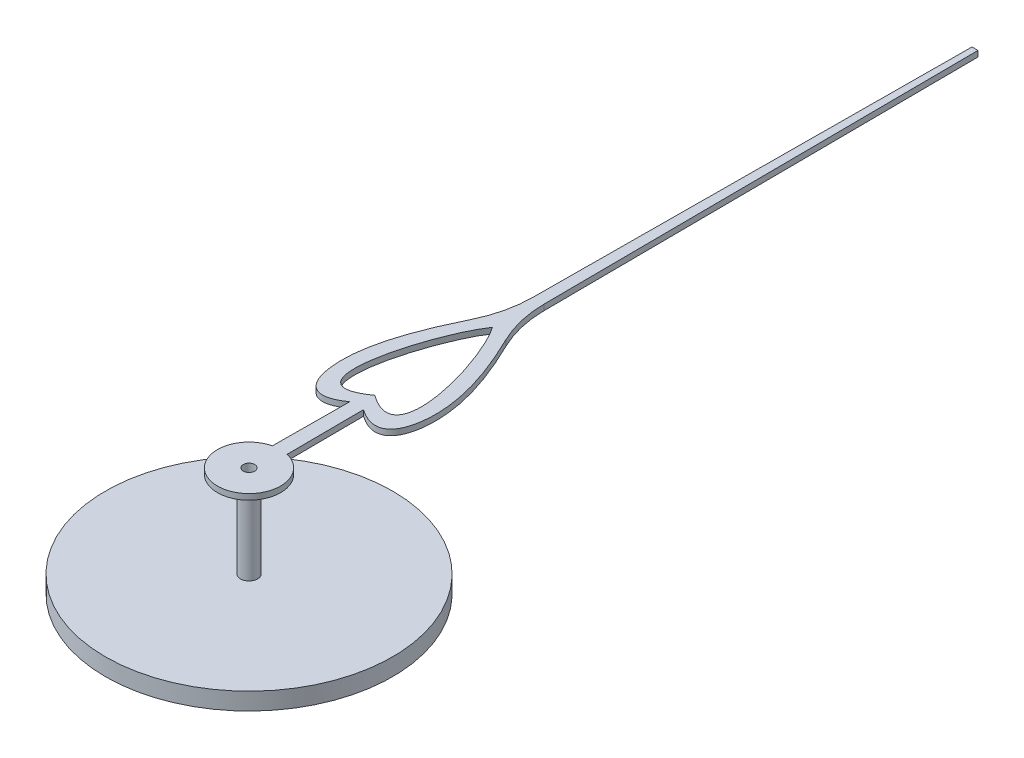
ISO-10303-21;
HEADER;
FILE_DESCRIPTION(('STEP AP214'),'2;1');
FILE_NAME('part.step','',(''),(''),'','','');
FILE_SCHEMA(('AUTOMOTIVE_DESIGN { 1 0 10303 214 1 1 1 1 }'));
ENDSEC;
DATA;
#1=APPLICATION_CONTEXT('core data for automotive mechanical design processes');
#2=APPLICATION_PROTOCOL_DEFINITION('international standard','automotive_design',2000,#1);
#3=PRODUCT_CONTEXT('',#1,'mechanical');
#4=PRODUCT('Part','Part','',(#3));
#5=PRODUCT_RELATED_PRODUCT_CATEGORY('part','',(#4));
#6=PRODUCT_DEFINITION_FORMATION('','',#4);
#7=PRODUCT_DEFINITION_CONTEXT('part definition',#1,'design');
#8=PRODUCT_DEFINITION('design','',#6,#7);
#9=PRODUCT_DEFINITION_SHAPE('','',#8);
#10=(LENGTH_UNIT() NAMED_UNIT(*) SI_UNIT(.MILLI.,.METRE.));
#11=(NAMED_UNIT(*) PLANE_ANGLE_UNIT() SI_UNIT($,.RADIAN.));
#12=(NAMED_UNIT(*) SI_UNIT($,.STERADIAN.) SOLID_ANGLE_UNIT());
#13=UNCERTAINTY_MEASURE_WITH_UNIT(LENGTH_MEASURE(1.E-05),#10,'distance_accuracy_value','');
#14=(GEOMETRIC_REPRESENTATION_CONTEXT(3) GLOBAL_UNCERTAINTY_ASSIGNED_CONTEXT((#13)) GLOBAL_UNIT_ASSIGNED_CONTEXT((#10,
#11,#12)) REPRESENTATION_CONTEXT('',''));
#15=CARTESIAN_POINT('',(0.,0.,0.));
#16=DIRECTION('',(0.,0.,1.));
#17=DIRECTION('',(1.,0.,0.));
#18=AXIS2_PLACEMENT_3D('',#15,#16,#17);
#19=CARTESIAN_POINT('',(-0.818484283328494,0.,-2.44789330945208));
#20=DIRECTION('',(0.,1.,0.));
#21=DIRECTION('',(0.,0.,1.));
#22=AXIS2_PLACEMENT_3D('',#19,#20,#21);
#23=PLANE('',#22);
#24=CARTESIAN_POINT('',(0.,0.,-2.18787424185007));
#25=CARTESIAN_POINT('',(1.05287403088658,0.,-1.43646078243729));
#26=CARTESIAN_POINT('',(0.435783261342512,0.,-3.61296055094113));
#27=CARTESIAN_POINT('',(0.,0.,-4.23880732225318));
#28=B_SPLINE_CURVE_WITH_KNOTS('',3,(#24,#25,#26,#27),.UNSPECIFIED.,.F.,.F.,(4,4),(0.,1.),.UNSPECIFIED.);
#29=CARTESIAN_POINT('',(0.,0.,-2.18787424185007));
#30=VERTEX_POINT('',#29);
#31=CARTESIAN_POINT('',(0.,0.,-4.23880732225318));
#32=VERTEX_POINT('',#31);
#33=EDGE_CURVE('E56',#30,#32,#28,.T.);
#34=ORIENTED_EDGE('',*,*,#33,.T.);
#35=CARTESIAN_POINT('',(0.,0.,-4.23880732225318));
#36=CARTESIAN_POINT('',(-0.435783261342511,0.,-3.61296055094112));
#37=CARTESIAN_POINT('',(-1.05287403088658,0.,-1.43646078243729));
#38=CARTESIAN_POINT('',(0.,0.,-2.18787424185007));
#39=B_SPLINE_CURVE_WITH_KNOTS('',3,(#35,#36,#37,#38),.UNSPECIFIED.,.F.,.F.,(4,4),(0.,1.),.UNSPECIFIED.);
#40=EDGE_CURVE('E133',#32,#30,#39,.T.);
#41=ORIENTED_EDGE('',*,*,#40,.T.);
#42=EDGE_LOOP('',(#34,#41));
#43=FACE_BOUND('',#42,.T.);
#44=CARTESIAN_POINT('',(-0.302826257694259,0.,-4.1712859886645));
#45=CARTESIAN_POINT('',(-0.624353855445742,0.,-3.51335934686763));
#46=CARTESIAN_POINT('',(-1.00426129114201,0.,-2.3859883039349));
#47=CARTESIAN_POINT('',(-0.641060695584215,0.,-1.50623728307088));
#48=CARTESIAN_POINT('',(-0.11954106823095,0.,-1.87342908304806));
#49=B_SPLINE_CURVE_WITH_KNOTS('',3,(#44,#45,#46,#47,#48),.UNSPECIFIED.,.F.,.F.,(4,1,4),(0.,
0.462172683660268,0.924345367320535),.UNSPECIFIED.);
#50=CARTESIAN_POINT('',(-0.302826257694231,0.,-4.17128598866449));
#51=VERTEX_POINT('',#50);
#52=CARTESIAN_POINT('',(-0.11954106823095,0.,-1.87342908304806));
#53=VERTEX_POINT('',#52);
#54=EDGE_CURVE('E209',#51,#53,#49,.T.);
#55=ORIENTED_EDGE('',*,*,#54,.F.);
#56=CARTESIAN_POINT('',(-2.09973012610236,0.,-5.04942976259905));
#57=DIRECTION('',(0.,-1.,0.));
#58=DIRECTION('',(0.,0.,1.));
#59=AXIS2_PLACEMENT_3D('',#56,#57,#58);
#60=CIRCLE('',#59,2.00000000000003);
#61=CARTESIAN_POINT('',(-0.0997691874579528,0.,-5.03693000673266));
#62=VERTEX_POINT('',#61);
#63=EDGE_CURVE('E238',#62,#51,#60,.T.);
#64=ORIENTED_EDGE('',*,*,#63,.F.);
#65=DIRECTION('',(-0.00624987793325496,0.,0.999980469322186));
#66=VECTOR('',#65,1.);
#67=CARTESIAN_POINT('',(-0.0997691874579205,0.,-5.03693000673266));
#68=LINE('',#67,#66);
#69=CARTESIAN_POINT('',(-0.0522609944425504,0.,-12.6382408892025));
#70=VERTEX_POINT('',#69);
#71=EDGE_CURVE('E236',#70,#62,#68,.T.);
#72=ORIENTED_EDGE('',*,*,#71,.F.);
#73=DIRECTION('',(-1.,0.,1.26135165988133E-12));
#74=VECTOR('',#73,1.);
#75=CARTESIAN_POINT('',(-0.0522609944425504,0.,-12.6382408892025));
#76=LINE('',#75,#74);
#77=CARTESIAN_POINT('',(0.0522609944424847,0.,-12.6382408892026));
#78=VERTEX_POINT('',#77);
#79=EDGE_CURVE('E234',#78,#70,#76,.T.);
#80=ORIENTED_EDGE('',*,*,#79,.F.);
#81=DIRECTION('',(-0.00624987793326353,0.,-0.999980469322186));
#82=VECTOR('',#81,1.);
#83=CARTESIAN_POINT('',(0.0997691874579205,0.,-5.03693000673271));
#84=LINE('',#83,#82);
#85=CARTESIAN_POINT('',(0.0997691874579205,0.,-5.03693000673271));
#86=VERTEX_POINT('',#85);
#87=EDGE_CURVE('E232',#86,#78,#84,.T.);
#88=ORIENTED_EDGE('',*,*,#87,.F.);
#89=CARTESIAN_POINT('',(2.09973012610229,0.,-5.04942976259924));
#90=DIRECTION('',(0.,-1.,0.));
#91=DIRECTION('',(0.,0.,-1.));
#92=AXIS2_PLACEMENT_3D('',#89,#90,#91);
#93=CIRCLE('',#92,2.);
#94=CARTESIAN_POINT('',(0.302826257694259,0.,-4.17128598866456));
#95=VERTEX_POINT('',#94);
#96=EDGE_CURVE('E227',#95,#86,#93,.T.);
#97=ORIENTED_EDGE('',*,*,#96,.F.);
#98=CARTESIAN_POINT('',(0.11954106823095,0.,-1.87342908304806));
#99=CARTESIAN_POINT('',(0.641060695584215,0.,-1.50623728307088));
#100=CARTESIAN_POINT('',(1.00426129114201,0.,-2.3859883039349));
#101=CARTESIAN_POINT('',(0.624353855445742,0.,-3.51335934686763));
#102=CARTESIAN_POINT('',(0.302826257694259,0.,-4.1712859886645));
#103=B_SPLINE_CURVE_WITH_KNOTS('',3,(#98,#99,#100,#101,#102),.UNSPECIFIED.,.F.,.F.,(4,1,4),(0.,
0.462172683660268,0.924345367320535),.UNSPECIFIED.);
#104=CARTESIAN_POINT('',(0.11954106823095,0.,-1.87342908304806));
#105=VERTEX_POINT('',#104);
#106=EDGE_CURVE('E223',#105,#95,#103,.T.);
#107=ORIENTED_EDGE('',*,*,#106,.F.);
#108=DIRECTION('',(-0.00624987793326341,0.,-0.999980469322186));
#109=VECTOR('',#108,1.);
#110=CARTESIAN_POINT('',(0.127906747326773,0.,-0.53492042771639));
#111=LINE('',#110,#109);
#112=CARTESIAN_POINT('',(0.127906747326773,0.,-0.53492042771639));
#113=VERTEX_POINT('',#112);
#114=EDGE_CURVE('E221',#113,#105,#111,.T.);
#115=ORIENTED_EDGE('',*,*,#114,.F.);
#116=CARTESIAN_POINT('',(0.,0.,0.));
#117=DIRECTION('',(0.,1.,0.));
#118=DIRECTION('',(0.,0.,1.));
#119=AXIS2_PLACEMENT_3D('',#116,#117,#118);
#120=CIRCLE('',#119,0.55);
#121=CARTESIAN_POINT('',(-0.127906747326772,0.,-0.534920427716389));
#122=VERTEX_POINT('',#121);
#123=EDGE_CURVE('E219',#122,#113,#120,.T.);
#124=ORIENTED_EDGE('',*,*,#123,.F.);
#125=DIRECTION('',(-0.00624987793326367,0.,0.999980469322186));
#126=VECTOR('',#125,1.);
#127=CARTESIAN_POINT('',(-0.127906747326773,0.,-0.53492042771639));
#128=LINE('',#127,#126);
#129=EDGE_CURVE('E214',#53,#122,#128,.T.);
#130=ORIENTED_EDGE('',*,*,#129,.F.);
#131=EDGE_LOOP('',(#55,#64,#72,#80,#88,#97,#107,#115,#124,#130));
#132=FACE_BOUND('',#131,.T.);
#133=CARTESIAN_POINT('',(0.,0.,0.));
#134=DIRECTION('',(0.,1.,0.));
#135=DIRECTION('',(0.,0.,1.));
#136=AXIS2_PLACEMENT_3D('',#133,#134,#135);
#137=CIRCLE('',#136,0.15);
#138=CARTESIAN_POINT('',(0.,0.,0.15));
#139=VERTEX_POINT('',#138);
#140=EDGE_CURVE('E11',#139,#139,#137,.F.);
#141=ORIENTED_EDGE('',*,*,#140,.F.);
#142=EDGE_LOOP('',(#141));
#143=FACE_BOUND('',#142,.T.);
#144=ADVANCED_FACE('F33',(#43,#132,#143),#23,.F.);
#145=CARTESIAN_POINT('',(-0.818484283328494,0.1,-2.44789330945208));
#146=DIRECTION('',(0.,1.,0.));
#147=DIRECTION('',(0.,0.,1.));
#148=AXIS2_PLACEMENT_3D('',#145,#146,#147);
#149=PLANE('',#148);
#150=CARTESIAN_POINT('',(0.,0.1,0.));
#151=DIRECTION('',(0.,1.,0.));
#152=DIRECTION('',(0.,0.,1.));
#153=AXIS2_PLACEMENT_3D('',#150,#151,#152);
#154=CIRCLE('',#153,0.1);
#155=CARTESIAN_POINT('',(0.,0.1,0.1));
#156=VERTEX_POINT('',#155);
#157=EDGE_CURVE('E324',#156,#156,#154,.T.);
#158=ORIENTED_EDGE('',*,*,#157,.F.);
#159=EDGE_LOOP('',(#158));
#160=FACE_BOUND('',#159,.T.);
#161=CARTESIAN_POINT('',(-0.302826257694259,0.1,-4.1712859886645));
#162=CARTESIAN_POINT('',(-0.624353855445742,0.1,-3.51335934686763));
#163=CARTESIAN_POINT('',(-1.00426129114201,0.1,-2.3859883039349));
#164=CARTESIAN_POINT('',(-0.641060695584215,0.1,-1.50623728307088));
#165=CARTESIAN_POINT('',(-0.11954106823095,0.1,-1.87342908304806));
#166=B_SPLINE_CURVE_WITH_KNOTS('',3,(#161,#162,#163,#164,#165),.UNSPECIFIED.,.F.,.F.,(4,1,4),
(0.,0.462172683660268,0.924345367320535),.UNSPECIFIED.);
#167=CARTESIAN_POINT('',(-0.302826257694231,0.1,-4.17128598866449));
#168=VERTEX_POINT('',#167);
#169=CARTESIAN_POINT('',(-0.11954106823095,0.1,-1.87342908304806));
#170=VERTEX_POINT('',#169);
#171=EDGE_CURVE('E240',#168,#170,#166,.T.);
#172=ORIENTED_EDGE('',*,*,#171,.T.);
#173=DIRECTION('',(-0.00624987793326367,0.,0.999980469322186));
#174=VECTOR('',#173,1.);
#175=CARTESIAN_POINT('',(-0.127906747326773,0.1,-0.53492042771639));
#176=LINE('',#175,#174);
#177=CARTESIAN_POINT('',(-0.127906747326772,0.1,-0.534920427716389));
#178=VERTEX_POINT('',#177);
#179=EDGE_CURVE('E271',#170,#178,#176,.T.);
#180=ORIENTED_EDGE('',*,*,#179,.T.);
#181=CARTESIAN_POINT('',(0.,0.1,0.));
#182=DIRECTION('',(0.,1.,0.));
#183=DIRECTION('',(0.,0.,1.));
#184=AXIS2_PLACEMENT_3D('',#181,#182,#183);
#185=CIRCLE('',#184,0.55);
#186=CARTESIAN_POINT('',(0.127906747326773,0.1,-0.53492042771639));
#187=VERTEX_POINT('',#186);
#188=EDGE_CURVE('E293',#178,#187,#185,.T.);
#189=ORIENTED_EDGE('',*,*,#188,.T.);
#190=DIRECTION('',(-0.00624987793326341,0.,-0.999980469322186));
#191=VECTOR('',#190,1.);
#192=CARTESIAN_POINT('',(0.127906747326773,0.1,-0.53492042771639));
#193=LINE('',#192,#191);
#194=CARTESIAN_POINT('',(0.11954106823095,0.1,-1.87342908304806));
#195=VERTEX_POINT('',#194);
#196=EDGE_CURVE('E194',#187,#195,#193,.T.);
#197=ORIENTED_EDGE('',*,*,#196,.T.);
#198=CARTESIAN_POINT('',(0.11954106823095,0.1,-1.87342908304806));
#199=CARTESIAN_POINT('',(0.641060695584215,0.1,-1.50623728307088));
#200=CARTESIAN_POINT('',(1.00426129114201,0.1,-2.3859883039349));
#201=CARTESIAN_POINT('',(0.624353855445742,0.1,-3.51335934686763));
#202=CARTESIAN_POINT('',(0.302826257694259,0.1,-4.1712859886645));
#203=B_SPLINE_CURVE_WITH_KNOTS('',3,(#198,#199,#200,#201,#202),.UNSPECIFIED.,.F.,.F.,(4,1,4),
(0.,0.462172683660268,0.924345367320535),.UNSPECIFIED.);
#204=CARTESIAN_POINT('',(0.302826257694259,0.1,-4.17128598866456));
#205=VERTEX_POINT('',#204);
#206=EDGE_CURVE('E187',#195,#205,#203,.T.);
#207=ORIENTED_EDGE('',*,*,#206,.T.);
#208=CARTESIAN_POINT('',(2.09973012610229,0.1,-5.04942976259924));
#209=DIRECTION('',(0.,-1.,0.));
#210=DIRECTION('',(0.,0.,-1.));
#211=AXIS2_PLACEMENT_3D('',#208,#209,#210);
#212=CIRCLE('',#211,2.);
#213=CARTESIAN_POINT('',(0.0997691874579205,0.1,-5.03693000673271));
#214=VERTEX_POINT('',#213);
#215=EDGE_CURVE('E193',#205,#214,#212,.T.);
#216=ORIENTED_EDGE('',*,*,#215,.T.);
#217=DIRECTION('',(-0.00624987793326353,0.,-0.999980469322186));
#218=VECTOR('',#217,1.);
#219=CARTESIAN_POINT('',(0.0997691874579205,0.1,-5.03693000673271));
#220=LINE('',#219,#218);
#221=CARTESIAN_POINT('',(0.0522609944424847,0.1,-12.6382408892026));
#222=VERTEX_POINT('',#221);
#223=EDGE_CURVE('E200',#214,#222,#220,.T.);
#224=ORIENTED_EDGE('',*,*,#223,.T.);
#225=DIRECTION('',(-1.,0.,1.26135165988133E-12));
#226=VECTOR('',#225,1.);
#227=CARTESIAN_POINT('',(-0.0522609944425504,0.1,-12.6382408892025));
#228=LINE('',#227,#226);
#229=CARTESIAN_POINT('',(-0.0522609944425504,0.1,-12.6382408892025));
#230=VERTEX_POINT('',#229);
#231=EDGE_CURVE('E202',#222,#230,#228,.T.);
#232=ORIENTED_EDGE('',*,*,#231,.T.);
#233=DIRECTION('',(-0.00624987793325496,0.,0.999980469322186));
#234=VECTOR('',#233,1.);
#235=CARTESIAN_POINT('',(-0.0997691874579205,0.1,-5.03693000673266));
#236=LINE('',#235,#234);
#237=CARTESIAN_POINT('',(-0.0997691874579528,0.1,-5.03693000673266));
#238=VERTEX_POINT('',#237);
#239=EDGE_CURVE('E204',#230,#238,#236,.T.);
#240=ORIENTED_EDGE('',*,*,#239,.T.);
#241=CARTESIAN_POINT('',(-2.09973012610236,0.1,-5.04942976259905));
#242=DIRECTION('',(0.,-1.,0.));
#243=DIRECTION('',(0.,0.,1.));
#244=AXIS2_PLACEMENT_3D('',#241,#242,#243);
#245=CIRCLE('',#244,2.00000000000003);
#246=EDGE_CURVE('E206',#238,#168,#245,.T.);
#247=ORIENTED_EDGE('',*,*,#246,.T.);
#248=EDGE_LOOP('',(#172,#180,#189,#197,#207,#216,#224,#232,#240,#247));
#249=FACE_BOUND('',#248,.T.);
#250=CARTESIAN_POINT('',(0.,0.1,-4.23880732225318));
#251=CARTESIAN_POINT('',(-0.435783261342511,0.1,-3.61296055094112));
#252=CARTESIAN_POINT('',(-1.05287403088658,0.1,-1.43646078243729));
#253=CARTESIAN_POINT('',(0.,0.1,-2.18787424185007));
#254=B_SPLINE_CURVE_WITH_KNOTS('',3,(#250,#251,#252,#253),.UNSPECIFIED.,.F.,.F.,(4,4),(0.,1.),.UNSPECIFIED.);
#255=CARTESIAN_POINT('',(0.,0.1,-4.23880732225318));
#256=VERTEX_POINT('',#255);
#257=CARTESIAN_POINT('',(0.,0.1,-2.18787424185007));
#258=VERTEX_POINT('',#257);
#259=EDGE_CURVE('E122',#256,#258,#254,.T.);
#260=ORIENTED_EDGE('',*,*,#259,.F.);
#261=CARTESIAN_POINT('',(0.,0.1,-2.18787424185007));
#262=CARTESIAN_POINT('',(1.05287403088658,0.1,-1.43646078243729));
#263=CARTESIAN_POINT('',(0.435783261342512,0.1,-3.61296055094113));
#264=CARTESIAN_POINT('',(0.,0.1,-4.23880732225318));
#265=B_SPLINE_CURVE_WITH_KNOTS('',3,(#261,#262,#263,#264),.UNSPECIFIED.,.F.,.F.,(4,4),(0.,1.),.UNSPECIFIED.);
#266=EDGE_CURVE('E128',#258,#256,#265,.T.);
#267=ORIENTED_EDGE('',*,*,#266,.F.);
#268=EDGE_LOOP('',(#260,#267));
#269=FACE_BOUND('',#268,.T.);
#270=ADVANCED_FACE('F132',(#160,#249,#269),#149,.T.);
#271=DIRECTION('',(0.,-1.,0.));
#272=VECTOR('',#271,1.);
#273=SURFACE_OF_LINEAR_EXTRUSION('',#166,#272);
#274=ORIENTED_EDGE('',*,*,#54,.T.);
#275=DIRECTION('',(0.,-1.,0.));
#276=VECTOR('',#275,1.);
#277=CARTESIAN_POINT('',(-0.11954106823095,0.1,-1.87342908304806));
#278=LINE('',#277,#276);
#279=EDGE_CURVE('E42',#170,#53,#278,.T.);
#280=ORIENTED_EDGE('',*,*,#279,.F.);
#281=ORIENTED_EDGE('',*,*,#171,.F.);
#282=DIRECTION('',(0.,-1.,0.));
#283=VECTOR('',#282,1.);
#284=CARTESIAN_POINT('',(-0.302826257694231,0.1,-4.17128598866449));
#285=LINE('',#284,#283);
#286=EDGE_CURVE('E208',#168,#51,#285,.T.);
#287=ORIENTED_EDGE('',*,*,#286,.T.);
#288=EDGE_LOOP('',(#274,#280,#281,#287));
#289=FACE_BOUND('',#288,.T.);
#290=ADVANCED_FACE('F35',(#289),#273,.F.);
#291=CARTESIAN_POINT('',(-0.127906747326773,0.1,-0.53492042771639));
#292=DIRECTION('',(0.999980469322186,0.,0.00624987793326367));
#293=DIRECTION('',(0.00624987793326367,0.,-0.999980469322186));
#294=AXIS2_PLACEMENT_3D('',#291,#292,#293);
#295=PLANE('',#294);
#296=ORIENTED_EDGE('',*,*,#129,.T.);
#297=DIRECTION('',(0.,-1.,0.));
#298=VECTOR('',#297,1.);
#299=CARTESIAN_POINT('',(-0.127906747326772,0.1,-0.534920427716389));
#300=LINE('',#299,#298);
#301=EDGE_CURVE('E264',#178,#122,#300,.T.);
#302=ORIENTED_EDGE('',*,*,#301,.F.);
#303=ORIENTED_EDGE('',*,*,#179,.F.);
#304=ORIENTED_EDGE('',*,*,#279,.T.);
#305=EDGE_LOOP('',(#296,#302,#303,#304));
#306=FACE_BOUND('',#305,.T.);
#307=ADVANCED_FACE('F269',(#306),#295,.F.);
#308=CARTESIAN_POINT('',(0.,0.1,0.));
#309=DIRECTION('',(0.,-1.,0.));
#310=DIRECTION('',(0.,0.,-1.));
#311=AXIS2_PLACEMENT_3D('',#308,#309,#310);
#312=CYLINDRICAL_SURFACE('',#311,0.55);
#313=ORIENTED_EDGE('',*,*,#123,.T.);
#314=DIRECTION('',(0.,-1.,0.));
#315=VECTOR('',#314,1.);
#316=CARTESIAN_POINT('',(0.127906747326773,0.1,-0.53492042771639));
#317=LINE('',#316,#315);
#318=EDGE_CURVE('E261',#187,#113,#317,.T.);
#319=ORIENTED_EDGE('',*,*,#318,.F.);
#320=ORIENTED_EDGE('',*,*,#188,.F.);
#321=ORIENTED_EDGE('',*,*,#301,.T.);
#322=EDGE_LOOP('',(#313,#319,#320,#321));
#323=FACE_BOUND('',#322,.T.);
#324=ADVANCED_FACE('F286',(#323),#312,.T.);
#325=CARTESIAN_POINT('',(0.127906747326773,0.1,-0.53492042771639));
#326=DIRECTION('',(-0.999980469322186,0.,0.00624987793326341));
#327=DIRECTION('',(0.00624987793326341,0.,0.999980469322186));
#328=AXIS2_PLACEMENT_3D('',#325,#326,#327);
#329=PLANE('',#328);
#330=ORIENTED_EDGE('',*,*,#114,.T.);
#331=DIRECTION('',(0.,-1.,0.));
#332=VECTOR('',#331,1.);
#333=CARTESIAN_POINT('',(0.11954106823095,0.1,-1.87342908304806));
#334=LINE('',#333,#332);
#335=EDGE_CURVE('E258',#195,#105,#334,.T.);
#336=ORIENTED_EDGE('',*,*,#335,.F.);
#337=ORIENTED_EDGE('',*,*,#196,.F.);
#338=ORIENTED_EDGE('',*,*,#318,.T.);
#339=EDGE_LOOP('',(#330,#336,#337,#338));
#340=FACE_BOUND('',#339,.T.);
#341=ADVANCED_FACE('F184',(#340),#329,.F.);
#342=DIRECTION('',(0.,-1.,0.));
#343=VECTOR('',#342,1.);
#344=SURFACE_OF_LINEAR_EXTRUSION('',#203,#343);
#345=ORIENTED_EDGE('',*,*,#106,.T.);
#346=DIRECTION('',(0.,-1.,0.));
#347=VECTOR('',#346,1.);
#348=CARTESIAN_POINT('',(0.302826257694259,0.1,-4.17128598866456));
#349=LINE('',#348,#347);
#350=EDGE_CURVE('E255',#205,#95,#349,.T.);
#351=ORIENTED_EDGE('',*,*,#350,.F.);
#352=ORIENTED_EDGE('',*,*,#206,.F.);
#353=ORIENTED_EDGE('',*,*,#335,.T.);
#354=EDGE_LOOP('',(#345,#351,#352,#353));
#355=FACE_BOUND('',#354,.T.);
#356=ADVANCED_FACE('F179',(#355),#344,.F.);
#357=CARTESIAN_POINT('',(2.09973012610229,0.1,-5.04942976259924));
#358=DIRECTION('',(0.,-1.,0.));
#359=DIRECTION('',(0.,0.,-1.));
#360=AXIS2_PLACEMENT_3D('',#357,#358,#359);
#361=CYLINDRICAL_SURFACE('',#360,2.);
#362=ORIENTED_EDGE('',*,*,#96,.T.);
#363=DIRECTION('',(0.,-1.,0.));
#364=VECTOR('',#363,1.);
#365=CARTESIAN_POINT('',(0.0997691874579205,0.1,-5.03693000673271));
#366=LINE('',#365,#364);
#367=EDGE_CURVE('E252',#214,#86,#366,.T.);
#368=ORIENTED_EDGE('',*,*,#367,.F.);
#369=ORIENTED_EDGE('',*,*,#215,.F.);
#370=ORIENTED_EDGE('',*,*,#350,.T.);
#371=EDGE_LOOP('',(#362,#368,#369,#370));
#372=FACE_BOUND('',#371,.T.);
#373=ADVANCED_FACE('F175',(#372),#361,.F.);
#374=CARTESIAN_POINT('',(0.0997691874579205,0.1,-5.03693000673271));
#375=DIRECTION('',(-0.999980469322186,0.,0.00624987793326353));
#376=DIRECTION('',(0.00624987793326354,0.,0.999980469322186));
#377=AXIS2_PLACEMENT_3D('',#374,#375,#376);
#378=PLANE('',#377);
#379=ORIENTED_EDGE('',*,*,#87,.T.);
#380=DIRECTION('',(0.,-1.,0.));
#381=VECTOR('',#380,1.);
#382=CARTESIAN_POINT('',(0.0522609944424847,0.1,-12.6382408892026));
#383=LINE('',#382,#381);
#384=EDGE_CURVE('E249',#222,#78,#383,.T.);
#385=ORIENTED_EDGE('',*,*,#384,.F.);
#386=ORIENTED_EDGE('',*,*,#223,.F.);
#387=ORIENTED_EDGE('',*,*,#367,.T.);
#388=EDGE_LOOP('',(#379,#385,#386,#387));
#389=FACE_BOUND('',#388,.T.);
#390=ADVANCED_FACE('F171',(#389),#378,.F.);
#391=CARTESIAN_POINT('',(-0.0522609944425504,0.1,-12.6382408892025));
#392=DIRECTION('',(1.26135165988133E-12,0.,1.));
#393=DIRECTION('',(1.,0.,-1.26135165988133E-12));
#394=AXIS2_PLACEMENT_3D('',#391,#392,#393);
#395=PLANE('',#394);
#396=ORIENTED_EDGE('',*,*,#79,.T.);
#397=DIRECTION('',(0.,-1.,0.));
#398=VECTOR('',#397,1.);
#399=CARTESIAN_POINT('',(-0.0522609944425504,0.1,-12.6382408892025));
#400=LINE('',#399,#398);
#401=EDGE_CURVE('E246',#230,#70,#400,.T.);
#402=ORIENTED_EDGE('',*,*,#401,.F.);
#403=ORIENTED_EDGE('',*,*,#231,.F.);
#404=ORIENTED_EDGE('',*,*,#384,.T.);
#405=EDGE_LOOP('',(#396,#402,#403,#404));
#406=FACE_BOUND('',#405,.T.);
#407=ADVANCED_FACE('F167',(#406),#395,.F.);
#408=CARTESIAN_POINT('',(-0.0997691874579205,0.1,-5.03693000673266));
#409=DIRECTION('',(0.999980469322186,0.,0.00624987793325496));
#410=DIRECTION('',(0.00624987793325496,0.,-0.999980469322186));
#411=AXIS2_PLACEMENT_3D('',#408,#409,#410);
#412=PLANE('',#411);
#413=ORIENTED_EDGE('',*,*,#71,.T.);
#414=DIRECTION('',(0.,-1.,0.));
#415=VECTOR('',#414,1.);
#416=CARTESIAN_POINT('',(-0.0997691874579528,0.1,-5.03693000673266));
#417=LINE('',#416,#415);
#418=EDGE_CURVE('E243',#238,#62,#417,.T.);
#419=ORIENTED_EDGE('',*,*,#418,.F.);
#420=ORIENTED_EDGE('',*,*,#239,.F.);
#421=ORIENTED_EDGE('',*,*,#401,.T.);
#422=EDGE_LOOP('',(#413,#419,#420,#421));
#423=FACE_BOUND('',#422,.T.);
#424=ADVANCED_FACE('F163',(#423),#412,.F.);
#425=CARTESIAN_POINT('',(-2.09973012610236,0.1,-5.04942976259905));
#426=DIRECTION('',(0.,-1.,0.));
#427=DIRECTION('',(0.,0.,-1.));
#428=AXIS2_PLACEMENT_3D('',#425,#426,#427);
#429=CYLINDRICAL_SURFACE('',#428,2.00000000000003);
#430=ORIENTED_EDGE('',*,*,#63,.T.);
#431=ORIENTED_EDGE('',*,*,#286,.F.);
#432=ORIENTED_EDGE('',*,*,#246,.F.);
#433=ORIENTED_EDGE('',*,*,#418,.T.);
#434=EDGE_LOOP('',(#430,#431,#432,#433));
#435=FACE_BOUND('',#434,.T.);
#436=ADVANCED_FACE('F153',(#435),#429,.F.);
#437=DIRECTION('',(0.,-1.,0.));
#438=VECTOR('',#437,1.);
#439=SURFACE_OF_LINEAR_EXTRUSION('',#265,#438);
#440=ORIENTED_EDGE('',*,*,#33,.F.);
#441=DIRECTION('',(0.,-1.,0.));
#442=VECTOR('',#441,1.);
#443=CARTESIAN_POINT('',(0.,0.1,-2.18787424185007));
#444=LINE('',#443,#442);
#445=EDGE_CURVE('E124',#258,#30,#444,.T.);
#446=ORIENTED_EDGE('',*,*,#445,.F.);
#447=ORIENTED_EDGE('',*,*,#266,.T.);
#448=DIRECTION('',(0.,-1.,0.));
#449=VECTOR('',#448,1.);
#450=CARTESIAN_POINT('',(0.,0.1,-4.23880732225318));
#451=LINE('',#450,#449);
#452=EDGE_CURVE('E49',#256,#32,#451,.T.);
#453=ORIENTED_EDGE('',*,*,#452,.T.);
#454=EDGE_LOOP('',(#440,#446,#447,#453));
#455=FACE_BOUND('',#454,.T.);
#456=ADVANCED_FACE('F130',(#455),#439,.T.);
#457=DIRECTION('',(0.,-1.,0.));
#458=VECTOR('',#457,1.);
#459=SURFACE_OF_LINEAR_EXTRUSION('',#254,#458);
#460=ORIENTED_EDGE('',*,*,#40,.F.);
#461=ORIENTED_EDGE('',*,*,#452,.F.);
#462=ORIENTED_EDGE('',*,*,#259,.T.);
#463=ORIENTED_EDGE('',*,*,#445,.T.);
#464=EDGE_LOOP('',(#460,#461,#462,#463));
#465=FACE_BOUND('',#464,.T.);
#466=ADVANCED_FACE('F123',(#465),#459,.T.);
#467=CARTESIAN_POINT('',(0.,-1.5,0.));
#468=DIRECTION('',(0.,1.,0.));
#469=DIRECTION('',(0.,0.,1.));
#470=AXIS2_PLACEMENT_3D('',#467,#468,#469);
#471=CYLINDRICAL_SURFACE('',#470,0.15);
#472=CARTESIAN_POINT('',(0.,-1.5,0.));
#473=DIRECTION('',(0.,-1.,0.));
#474=DIRECTION('',(0.,0.,-1.));
#475=AXIS2_PLACEMENT_3D('',#472,#473,#474);
#476=CIRCLE('',#475,0.15);
#477=CARTESIAN_POINT('',(0.,-1.5,-0.15));
#478=VERTEX_POINT('',#477);
#479=EDGE_CURVE('E140',#478,#478,#476,.T.);
#480=ORIENTED_EDGE('',*,*,#479,.F.);
#481=EDGE_LOOP('',(#480));
#482=FACE_BOUND('',#481,.T.);
#483=ORIENTED_EDGE('',*,*,#140,.T.);
#484=EDGE_LOOP('',(#483));
#485=FACE_BOUND('',#484,.T.);
#486=ADVANCED_FACE('F359',(#482,#485),#471,.T.);
#487=CARTESIAN_POINT('',(0.,-1.5,0.));
#488=DIRECTION('',(0.,-1.,0.));
#489=DIRECTION('',(0.,0.,-1.));
#490=AXIS2_PLACEMENT_3D('',#487,#488,#489);
#491=PLANE('',#490);
#492=CARTESIAN_POINT('',(0.,-1.5,0.));
#493=DIRECTION('',(0.,-1.,0.));
#494=DIRECTION('',(0.,0.,-1.));
#495=AXIS2_PLACEMENT_3D('',#492,#493,#494);
#496=CIRCLE('',#495,2.5);
#497=CARTESIAN_POINT('',(0.,-1.5,-2.5));
#498=VERTEX_POINT('',#497);
#499=EDGE_CURVE('E317',#498,#498,#496,.T.);
#500=ORIENTED_EDGE('',*,*,#499,.F.);
#501=EDGE_LOOP('',(#500));
#502=FACE_BOUND('',#501,.T.);
#503=ORIENTED_EDGE('',*,*,#479,.T.);
#504=EDGE_LOOP('',(#503));
#505=FACE_BOUND('',#504,.T.);
#506=ADVANCED_FACE('F356',(#502,#505),#491,.F.);
#507=CARTESIAN_POINT('',(0.,-1.8,0.));
#508=DIRECTION('',(0.,1.,0.));
#509=DIRECTION('',(0.,0.,1.));
#510=AXIS2_PLACEMENT_3D('',#507,#508,#509);
#511=CYLINDRICAL_SURFACE('',#510,2.5);
#512=CARTESIAN_POINT('',(0.,-1.8,0.));
#513=DIRECTION('',(0.,-1.,0.));
#514=DIRECTION('',(0.,0.,-1.));
#515=AXIS2_PLACEMENT_3D('',#512,#513,#514);
#516=CIRCLE('',#515,2.5);
#517=CARTESIAN_POINT('',(0.,-1.8,-2.5));
#518=VERTEX_POINT('',#517);
#519=EDGE_CURVE('E313',#518,#518,#516,.T.);
#520=ORIENTED_EDGE('',*,*,#519,.F.);
#521=EDGE_LOOP('',(#520));
#522=FACE_BOUND('',#521,.T.);
#523=ORIENTED_EDGE('',*,*,#499,.T.);
#524=EDGE_LOOP('',(#523));
#525=FACE_BOUND('',#524,.T.);
#526=ADVANCED_FACE('F353',(#522,#525),#511,.T.);
#527=CARTESIAN_POINT('',(0.,-1.8,0.));
#528=DIRECTION('',(0.,-1.,0.));
#529=DIRECTION('',(0.,0.,-1.));
#530=AXIS2_PLACEMENT_3D('',#527,#528,#529);
#531=PLANE('',#530);
#532=CARTESIAN_POINT('',(0.,-1.8,0.));
#533=DIRECTION('',(0.,1.,0.));
#534=DIRECTION('',(0.,0.,1.));
#535=AXIS2_PLACEMENT_3D('',#532,#533,#534);
#536=CIRCLE('',#535,0.1);
#537=CARTESIAN_POINT('',(0.,-1.8,0.1));
#538=VERTEX_POINT('',#537);
#539=EDGE_CURVE('E322',#538,#538,#536,.T.);
#540=ORIENTED_EDGE('',*,*,#539,.T.);
#541=EDGE_LOOP('',(#540));
#542=FACE_BOUND('',#541,.T.);
#543=ORIENTED_EDGE('',*,*,#519,.T.);
#544=EDGE_LOOP('',(#543));
#545=FACE_BOUND('',#544,.T.);
#546=ADVANCED_FACE('F330',(#542,#545),#531,.T.);
#547=CARTESIAN_POINT('',(0.,-1.8,0.));
#548=DIRECTION('',(0.,1.,0.));
#549=DIRECTION('',(0.,0.,1.));
#550=AXIS2_PLACEMENT_3D('',#547,#548,#549);
#551=CYLINDRICAL_SURFACE('',#550,0.1);
#552=ORIENTED_EDGE('',*,*,#539,.F.);
#553=EDGE_LOOP('',(#552));
#554=FACE_BOUND('',#553,.T.);
#555=ORIENTED_EDGE('',*,*,#157,.T.);
#556=EDGE_LOOP('',(#555));
#557=FACE_BOUND('',#556,.T.);
#558=ADVANCED_FACE('F332',(#554,#557),#551,.F.);
#559=CLOSED_SHELL('',(#144,#270,#290,#307,#324,#341,#356,#373,#390,#407,#424,#436,#456,#466,
#486,#506,#526,#546,#558));
#560=MANIFOLD_SOLID_BREP('B2',#559);
#561=ADVANCED_BREP_SHAPE_REPRESENTATION('',(#18,#560),#14);
#562=SHAPE_DEFINITION_REPRESENTATION(#9,#561);
ENDSEC;
END-ISO-10303-21;
